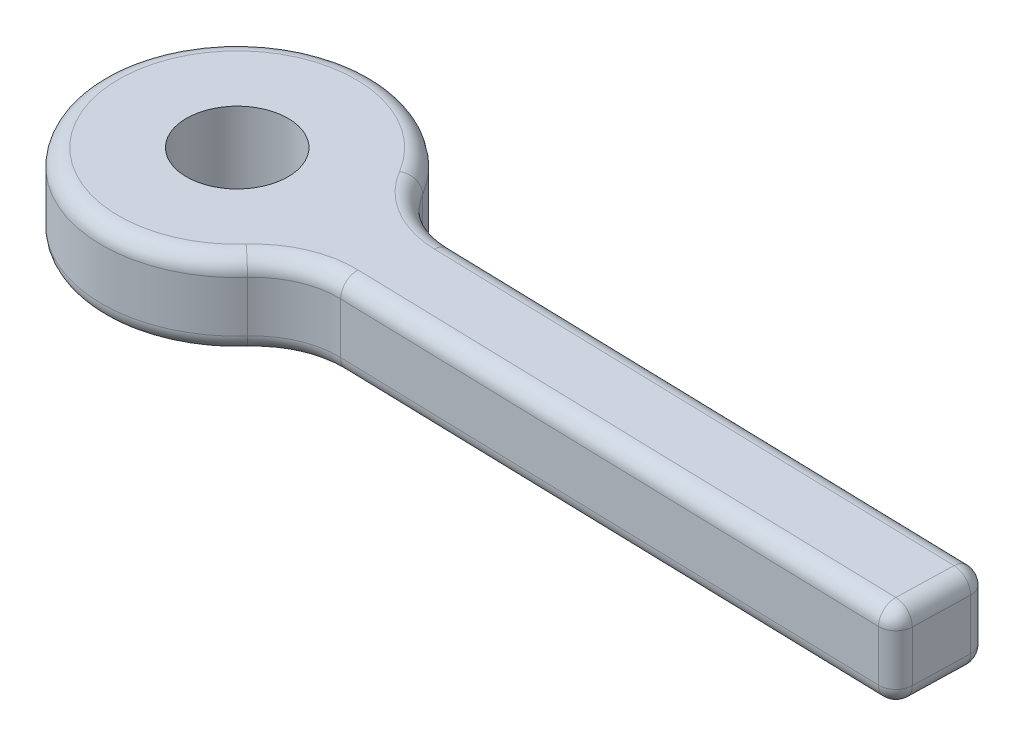
ISO-10303-21;
HEADER;
FILE_DESCRIPTION(('STEP AP214'),'2;1');
FILE_NAME('part.step','',(''),(''),'','','');
FILE_SCHEMA(('AUTOMOTIVE_DESIGN { 1 0 10303 214 1 1 1 1 }'));
ENDSEC;
DATA;
#1=APPLICATION_CONTEXT('core data for automotive mechanical design processes');
#2=APPLICATION_PROTOCOL_DEFINITION('international standard','automotive_design',2000,#1);
#3=PRODUCT_CONTEXT('',#1,'mechanical');
#4=PRODUCT('Part','Part','',(#3));
#5=PRODUCT_RELATED_PRODUCT_CATEGORY('part','',(#4));
#6=PRODUCT_DEFINITION_FORMATION('','',#4);
#7=PRODUCT_DEFINITION_CONTEXT('part definition',#1,'design');
#8=PRODUCT_DEFINITION('design','',#6,#7);
#9=PRODUCT_DEFINITION_SHAPE('','',#8);
#10=(LENGTH_UNIT() NAMED_UNIT(*) SI_UNIT(.MILLI.,.METRE.));
#11=(NAMED_UNIT(*) PLANE_ANGLE_UNIT() SI_UNIT($,.RADIAN.));
#12=(NAMED_UNIT(*) SI_UNIT($,.STERADIAN.) SOLID_ANGLE_UNIT());
#13=UNCERTAINTY_MEASURE_WITH_UNIT(LENGTH_MEASURE(1.E-05),#10,'distance_accuracy_value','');
#14=(GEOMETRIC_REPRESENTATION_CONTEXT(3) GLOBAL_UNCERTAINTY_ASSIGNED_CONTEXT((#13)) GLOBAL_UNIT_ASSIGNED_CONTEXT((#10,
#11,#12)) REPRESENTATION_CONTEXT('',''));
#15=CARTESIAN_POINT('',(0.,0.,0.));
#16=DIRECTION('',(0.,0.,1.));
#17=DIRECTION('',(1.,0.,0.));
#18=AXIS2_PLACEMENT_3D('',#15,#16,#17);
#19=CARTESIAN_POINT('',(0.423527405995183,116.08,-15.838627532734));
#20=DIRECTION('',(-0.0267306032413579,0.,0.999642673584093));
#21=DIRECTION('',(0.999642673584093,0.,0.0267306032413579));
#22=AXIS2_PLACEMENT_3D('',#19,#20,#21);
#23=PLANE('',#22);
#24=DIRECTION('',(0.,1.,0.));
#25=VECTOR('',#24,1.);
#26=CARTESIAN_POINT('',(5.37512005492349,116.08,-15.7062211619288));
#27=LINE('',#26,#25);
#28=CARTESIAN_POINT('',(5.37512005492349,117.08,-15.7062211619288));
#29=VERTEX_POINT('',#28);
#30=CARTESIAN_POINT('',(5.37512005492349,120.08,-15.7062211619288));
#31=VERTEX_POINT('',#30);
#32=EDGE_CURVE('E240',#29,#31,#27,.T.);
#33=ORIENTED_EDGE('',*,*,#32,.T.);
#34=DIRECTION('',(0.999642673584093,0.,0.0267306032413579));
#35=VECTOR('',#34,1.);
#36=CARTESIAN_POINT('',(-27.2826435868739,120.08,-16.5794949283727));
#37=LINE('',#36,#35);
#38=CARTESIAN_POINT('',(-27.2826435868739,120.08,-16.5794949283727));
#39=VERTEX_POINT('',#38);
#40=EDGE_CURVE('E242',#31,#39,#37,.F.);
#41=ORIENTED_EDGE('',*,*,#40,.T.);
#42=DIRECTION('',(0.,1.,0.));
#43=VECTOR('',#42,1.);
#44=CARTESIAN_POINT('',(-27.2826435868739,116.08,-16.5794949283727));
#45=LINE('',#44,#43);
#46=CARTESIAN_POINT('',(-27.2826435868739,117.08,-16.5794949283727));
#47=VERTEX_POINT('',#46);
#48=EDGE_CURVE('E160',#47,#39,#45,.T.);
#49=ORIENTED_EDGE('',*,*,#48,.F.);
#50=DIRECTION('',(0.999642673584093,0.,0.0267306032413579));
#51=VECTOR('',#50,1.);
#52=CARTESIAN_POINT('',(0.423527405995183,117.08,-15.838627532734));
#53=LINE('',#52,#51);
#54=EDGE_CURVE('E238',#47,#29,#53,.T.);
#55=ORIENTED_EDGE('',*,*,#54,.T.);
#56=EDGE_LOOP('',(#33,#41,#49,#55));
#57=FACE_BOUND('',#56,.T.);
#58=ADVANCED_FACE('F37',(#57),#23,.T.);
#59=CARTESIAN_POINT('',(-27.4162966030807,116.08,-11.5812815604523));
#60=DIRECTION('',(0.,1.,0.));
#61=DIRECTION('',(0.,0.,1.));
#62=AXIS2_PLACEMENT_3D('',#59,#60,#61);
#63=CYLINDRICAL_SURFACE('',#62,5.);
#64=ORIENTED_EDGE('',*,*,#48,.T.);
#65=CARTESIAN_POINT('',(-27.4162966030807,120.08,-11.5812815604523));
#66=DIRECTION('',(0.,-1.,0.));
#67=DIRECTION('',(0.,0.,-1.));
#68=AXIS2_PLACEMENT_3D('',#65,#66,#67);
#69=CIRCLE('',#68,5.);
#70=CARTESIAN_POINT('',(-31.1353115917015,120.08,-14.9232761018024));
#71=VERTEX_POINT('',#70);
#72=EDGE_CURVE('E247',#39,#71,#69,.F.);
#73=ORIENTED_EDGE('',*,*,#72,.T.);
#74=DIRECTION('',(0.,1.,0.));
#75=VECTOR('',#74,1.);
#76=CARTESIAN_POINT('',(-31.1353115917015,116.08,-14.9232761018024));
#77=LINE('',#76,#75);
#78=CARTESIAN_POINT('',(-31.1353115917015,117.08,-14.9232761018024));
#79=VERTEX_POINT('',#78);
#80=EDGE_CURVE('E227',#79,#71,#77,.T.);
#81=ORIENTED_EDGE('',*,*,#80,.F.);
#82=CARTESIAN_POINT('',(-27.4162966030807,117.08,-11.5812815604523));
#83=DIRECTION('',(0.,-1.,0.));
#84=DIRECTION('',(0.,0.,-1.));
#85=AXIS2_PLACEMENT_3D('',#82,#83,#84);
#86=CIRCLE('',#85,5.);
#87=EDGE_CURVE('E245',#79,#47,#86,.T.);
#88=ORIENTED_EDGE('',*,*,#87,.T.);
#89=EDGE_LOOP('',(#64,#73,#81,#88));
#90=FACE_BOUND('',#89,.T.);
#91=ADVANCED_FACE('F354',(#90),#63,.F.);
#92=CARTESIAN_POINT('',(-37.0857355734948,116.08,-20.2704673679625));
#93=DIRECTION('',(0.,1.,0.));
#94=DIRECTION('',(0.,0.,1.));
#95=AXIS2_PLACEMENT_3D('',#92,#93,#94);
#96=CYLINDRICAL_SURFACE('',#95,7.99999999999999);
#97=ORIENTED_EDGE('',*,*,#80,.T.);
#98=CARTESIAN_POINT('',(-37.0857355734948,120.08,-20.2704673679625));
#99=DIRECTION('',(0.,-1.,0.));
#100=DIRECTION('',(0.,0.,-1.));
#101=AXIS2_PLACEMENT_3D('',#98,#99,#100);
#102=CIRCLE('',#101,7.99999999999999);
#103=CARTESIAN_POINT('',(-30.2042001794121,120.08,-24.3502309174818));
#104=VERTEX_POINT('',#103);
#105=EDGE_CURVE('E251',#71,#104,#102,.T.);
#106=ORIENTED_EDGE('',*,*,#105,.T.);
#107=DIRECTION('',(0.,1.,0.));
#108=VECTOR('',#107,1.);
#109=CARTESIAN_POINT('',(-30.2042001794121,116.08,-24.3502309174818));
#110=LINE('',#109,#108);
#111=CARTESIAN_POINT('',(-30.2042001794121,117.08,-24.3502309174818));
#112=VERTEX_POINT('',#111);
#113=EDGE_CURVE('E224',#112,#104,#110,.T.);
#114=ORIENTED_EDGE('',*,*,#113,.F.);
#115=CARTESIAN_POINT('',(-37.0857355734948,117.08,-20.2704673679625));
#116=DIRECTION('',(0.,-1.,0.));
#117=DIRECTION('',(0.,0.,-1.));
#118=AXIS2_PLACEMENT_3D('',#115,#116,#117);
#119=CIRCLE('',#118,7.99999999999999);
#120=EDGE_CURVE('E249',#112,#79,#119,.F.);
#121=ORIENTED_EDGE('',*,*,#120,.T.);
#122=EDGE_LOOP('',(#97,#106,#114,#121));
#123=FACE_BOUND('',#122,.T.);
#124=ADVANCED_FACE('F302',(#123),#96,.T.);
#125=CARTESIAN_POINT('',(-25.9032405581103,116.08,-26.9000831359313));
#126=DIRECTION('',(0.,1.,0.));
#127=DIRECTION('',(0.,0.,1.));
#128=AXIS2_PLACEMENT_3D('',#125,#126,#127);
#129=CYLINDRICAL_SURFACE('',#128,5.);
#130=ORIENTED_EDGE('',*,*,#113,.T.);
#131=CARTESIAN_POINT('',(-25.9032405581103,120.08,-26.9000831359313));
#132=DIRECTION('',(0.,-1.,0.));
#133=DIRECTION('',(0.,0.,-1.));
#134=AXIS2_PLACEMENT_3D('',#131,#132,#133);
#135=CIRCLE('',#134,5.);
#136=CARTESIAN_POINT('',(-26.0368935743171,120.08,-21.9018697680109));
#137=VERTEX_POINT('',#136);
#138=EDGE_CURVE('E255',#104,#137,#135,.F.);
#139=ORIENTED_EDGE('',*,*,#138,.T.);
#140=DIRECTION('',(0.,1.,0.));
#141=VECTOR('',#140,1.);
#142=CARTESIAN_POINT('',(-26.0368935743171,116.08,-21.9018697680109));
#143=LINE('',#142,#141);
#144=CARTESIAN_POINT('',(-26.0368935743171,117.08,-21.9018697680109));
#145=VERTEX_POINT('',#144);
#146=EDGE_CURVE('E219',#145,#137,#143,.T.);
#147=ORIENTED_EDGE('',*,*,#146,.F.);
#148=CARTESIAN_POINT('',(-25.9032405581103,117.08,-26.9000831359313));
#149=DIRECTION('',(0.,-1.,0.));
#150=DIRECTION('',(0.,0.,-1.));
#151=AXIS2_PLACEMENT_3D('',#148,#149,#150);
#152=CIRCLE('',#151,5.);
#153=EDGE_CURVE('E253',#145,#112,#152,.T.);
#154=ORIENTED_EDGE('',*,*,#153,.T.);
#155=EDGE_LOOP('',(#130,#139,#147,#154));
#156=FACE_BOUND('',#155,.T.);
#157=ADVANCED_FACE('F306',(#156),#129,.F.);
#158=CARTESIAN_POINT('',(0.566636978916621,116.08,-21.1904871521726));
#159=DIRECTION('',(0.0267306032413582,0.,-0.999642673584093));
#160=DIRECTION('',(-0.999642673584093,0.,-0.0267306032413582));
#161=AXIS2_PLACEMENT_3D('',#158,#159,#160);
#162=PLANE('',#161);
#163=DIRECTION('',(0.,1.,0.));
#164=VECTOR('',#163,1.);
#165=CARTESIAN_POINT('',(5.51822962784493,116.08,-21.0580807813673));
#166=LINE('',#165,#164);
#167=CARTESIAN_POINT('',(5.51822962784493,120.08,-21.0580807813673));
#168=VERTEX_POINT('',#167);
#169=CARTESIAN_POINT('',(5.51822962784493,117.08,-21.0580807813673));
#170=VERTEX_POINT('',#169);
#171=EDGE_CURVE('E259',#168,#170,#166,.F.);
#172=ORIENTED_EDGE('',*,*,#171,.T.);
#173=DIRECTION('',(-0.999642673584093,0.,-0.0267306032413582));
#174=VECTOR('',#173,1.);
#175=CARTESIAN_POINT('',(0.566636978916621,117.08,-21.1904871521726));
#176=LINE('',#175,#174);
#177=EDGE_CURVE('E261',#170,#145,#176,.T.);
#178=ORIENTED_EDGE('',*,*,#177,.T.);
#179=ORIENTED_EDGE('',*,*,#146,.T.);
#180=DIRECTION('',(-0.999642673584093,0.,-0.0267306032413582));
#181=VECTOR('',#180,1.);
#182=CARTESIAN_POINT('',(6.51787230142902,120.08,-21.031350178126));
#183=LINE('',#182,#181);
#184=EDGE_CURVE('E257',#137,#168,#183,.F.);
#185=ORIENTED_EDGE('',*,*,#184,.T.);
#186=EDGE_LOOP('',(#172,#178,#179,#185));
#187=FACE_BOUND('',#186,.T.);
#188=ADVANCED_FACE('F348',(#187),#162,.T.);
#189=CARTESIAN_POINT('',(-37.0857355734948,116.08,-20.2704673679625));
#190=DIRECTION('',(0.,1.,0.));
#191=DIRECTION('',(0.,0.,1.));
#192=AXIS2_PLACEMENT_3D('',#189,#190,#191);
#193=CYLINDRICAL_SURFACE('',#192,3.);
#194=CARTESIAN_POINT('',(-37.0857355734948,116.08,-20.2704673679625));
#195=DIRECTION('',(0.,-1.,0.));
#196=DIRECTION('',(0.,0.,-1.));
#197=AXIS2_PLACEMENT_3D('',#194,#195,#196);
#198=CIRCLE('',#197,3.);
#199=CARTESIAN_POINT('',(-37.0857355734948,116.08,-23.2704673679625));
#200=VERTEX_POINT('',#199);
#201=EDGE_CURVE('E215',#200,#200,#198,.T.);
#202=ORIENTED_EDGE('',*,*,#201,.T.);
#203=EDGE_LOOP('',(#202));
#204=FACE_BOUND('',#203,.T.);
#205=CARTESIAN_POINT('',(-37.0857355734948,121.08,-20.2704673679625));
#206=DIRECTION('',(0.,-1.,0.));
#207=DIRECTION('',(0.,0.,-1.));
#208=AXIS2_PLACEMENT_3D('',#205,#206,#207);
#209=CIRCLE('',#208,3.);
#210=CARTESIAN_POINT('',(-37.0857355734948,121.08,-23.2704673679625));
#211=VERTEX_POINT('',#210);
#212=EDGE_CURVE('E209',#211,#211,#209,.T.);
#213=ORIENTED_EDGE('',*,*,#212,.F.);
#214=EDGE_LOOP('',(#213));
#215=FACE_BOUND('',#214,.T.);
#216=ADVANCED_FACE('F340',(#204,#215),#193,.F.);
#217=CARTESIAN_POINT('',(5.9512353225124,116.08,0.159136974046608));
#218=DIRECTION('',(0.999642673584093,0.,0.026730603241358));
#219=DIRECTION('',(0.026730603241358,0.,-0.999642673584093));
#220=AXIS2_PLACEMENT_3D('',#217,#218,#219);
#221=PLANE('',#220);
#222=DIRECTION('',(0.026730603241358,0.,-0.999642673584093));
#223=VECTOR('',#222,1.);
#224=CARTESIAN_POINT('',(5.9512353225124,117.08,0.159136974046608));
#225=LINE('',#224,#223);
#226=CARTESIAN_POINT('',(6.40149333174894,117.08,-16.6791332322715));
#227=VERTEX_POINT('',#226);
#228=CARTESIAN_POINT('',(6.49114169818766,117.08,-20.0317075045419));
#229=VERTEX_POINT('',#228);
#230=EDGE_CURVE('E46',#227,#229,#225,.T.);
#231=ORIENTED_EDGE('',*,*,#230,.T.);
#232=DIRECTION('',(0.,1.,0.));
#233=VECTOR('',#232,1.);
#234=CARTESIAN_POINT('',(6.49114169818766,116.08,-20.0317075045419));
#235=LINE('',#234,#233);
#236=CARTESIAN_POINT('',(6.49114169818766,120.08,-20.0317075045419));
#237=VERTEX_POINT('',#236);
#238=EDGE_CURVE('E11',#229,#237,#235,.T.);
#239=ORIENTED_EDGE('',*,*,#238,.T.);
#240=DIRECTION('',(0.026730603241358,0.,-0.999642673584093));
#241=VECTOR('',#240,1.);
#242=CARTESIAN_POINT('',(6.37476272850759,120.08,-15.6794905586874));
#243=LINE('',#242,#241);
#244=CARTESIAN_POINT('',(6.40149333174894,120.08,-16.6791332322715));
#245=VERTEX_POINT('',#244);
#246=EDGE_CURVE('E170',#237,#245,#243,.F.);
#247=ORIENTED_EDGE('',*,*,#246,.T.);
#248=DIRECTION('',(0.,1.,0.));
#249=VECTOR('',#248,1.);
#250=CARTESIAN_POINT('',(6.40149333174894,116.08,-16.6791332322715));
#251=LINE('',#250,#249);
#252=EDGE_CURVE('E57',#245,#227,#251,.F.);
#253=ORIENTED_EDGE('',*,*,#252,.T.);
#254=EDGE_LOOP('',(#231,#239,#247,#253));
#255=FACE_BOUND('',#254,.T.);
#256=ADVANCED_FACE('F337',(#255),#221,.T.);
#257=CARTESIAN_POINT('',(0.,116.08,0.));
#258=DIRECTION('',(0.,-1.,0.));
#259=DIRECTION('',(0.,0.,-1.));
#260=AXIS2_PLACEMENT_3D('',#257,#258,#259);
#261=PLANE('',#260);
#262=CARTESIAN_POINT('',(-25.9032405581103,116.08,-26.9000831359313));
#263=DIRECTION('',(0.,-1.,0.));
#264=DIRECTION('',(0.,0.,-1.));
#265=AXIS2_PLACEMENT_3D('',#262,#263,#264);
#266=CIRCLE('',#265,6.);
#267=CARTESIAN_POINT('',(-31.0643921036724,116.08,-23.8402604737919));
#268=VERTEX_POINT('',#267);
#269=CARTESIAN_POINT('',(-26.0636241775585,116.08,-20.9022270944268));
#270=VERTEX_POINT('',#269);
#271=EDGE_CURVE('E271',#268,#270,#266,.F.);
#272=ORIENTED_EDGE('',*,*,#271,.T.);
#273=DIRECTION('',(-0.999642673584093,0.,-0.0267306032413582));
#274=VECTOR('',#273,1.);
#275=CARTESIAN_POINT('',(0.539906375675262,116.08,-20.1908444785885));
#276=LINE('',#275,#274);
#277=CARTESIAN_POINT('',(5.49149902460357,116.08,-20.0584381077832));
#278=VERTEX_POINT('',#277);
#279=EDGE_CURVE('E273',#270,#278,#276,.F.);
#280=ORIENTED_EDGE('',*,*,#279,.T.);
#281=DIRECTION('',(0.026730603241358,0.,-0.999642673584093));
#282=VECTOR('',#281,1.);
#283=CARTESIAN_POINT('',(4.95159264892831,116.08,0.132406370805251));
#284=LINE('',#283,#282);
#285=CARTESIAN_POINT('',(5.40185065816485,116.08,-16.7058638355128));
#286=VERTEX_POINT('',#285);
#287=EDGE_CURVE('E265',#278,#286,#284,.F.);
#288=ORIENTED_EDGE('',*,*,#287,.T.);
#289=DIRECTION('',(0.999642673584093,0.,0.0267306032413579));
#290=VECTOR('',#289,1.);
#291=CARTESIAN_POINT('',(0.450258009236541,116.08,-16.8382702063181));
#292=LINE('',#291,#290);
#293=CARTESIAN_POINT('',(-27.2559129836326,116.08,-17.5791376019568));
#294=VERTEX_POINT('',#293);
#295=EDGE_CURVE('E263',#286,#294,#292,.F.);
#296=ORIENTED_EDGE('',*,*,#295,.T.);
#297=CARTESIAN_POINT('',(-27.4162966030807,116.08,-11.5812815604523));
#298=DIRECTION('',(0.,-1.,0.));
#299=DIRECTION('',(0.,0.,-1.));
#300=AXIS2_PLACEMENT_3D('',#297,#298,#299);
#301=CIRCLE('',#300,6.);
#302=CARTESIAN_POINT('',(-31.8791145894257,116.08,-15.5916750100724));
#303=VERTEX_POINT('',#302);
#304=EDGE_CURVE('E267',#294,#303,#301,.F.);
#305=ORIENTED_EDGE('',*,*,#304,.T.);
#306=CARTESIAN_POINT('',(-37.0857355734948,116.08,-20.2704673679625));
#307=DIRECTION('',(0.,-1.,0.));
#308=DIRECTION('',(0.,0.,-1.));
#309=AXIS2_PLACEMENT_3D('',#306,#307,#308);
#310=CIRCLE('',#309,6.99999999999999);
#311=EDGE_CURVE('E269',#303,#268,#310,.T.);
#312=ORIENTED_EDGE('',*,*,#311,.T.);
#313=EDGE_LOOP('',(#272,#280,#288,#296,#305,#312));
#314=FACE_BOUND('',#313,.T.);
#315=ORIENTED_EDGE('',*,*,#201,.F.);
#316=EDGE_LOOP('',(#315));
#317=FACE_BOUND('',#316,.T.);
#318=ADVANCED_FACE('F339',(#314,#317),#261,.T.);
#319=CARTESIAN_POINT('',(0.,121.08,0.));
#320=DIRECTION('',(0.,-1.,0.));
#321=DIRECTION('',(0.,0.,-1.));
#322=AXIS2_PLACEMENT_3D('',#319,#320,#321);
#323=PLANE('',#322);
#324=CARTESIAN_POINT('',(-27.4162966030807,121.08,-11.5812815604523));
#325=DIRECTION('',(0.,-1.,0.));
#326=DIRECTION('',(0.,0.,-1.));
#327=AXIS2_PLACEMENT_3D('',#324,#325,#326);
#328=CIRCLE('',#327,6.);
#329=CARTESIAN_POINT('',(-31.8791145894257,121.08,-15.5916750100724));
#330=VERTEX_POINT('',#329);
#331=CARTESIAN_POINT('',(-27.2559129836326,121.08,-17.5791376019568));
#332=VERTEX_POINT('',#331);
#333=EDGE_CURVE('E235',#330,#332,#328,.T.);
#334=ORIENTED_EDGE('',*,*,#333,.T.);
#335=DIRECTION('',(0.999642673584093,0.,0.0267306032413579));
#336=VECTOR('',#335,1.);
#337=CARTESIAN_POINT('',(6.40149333174895,121.08,-16.6791332322715));
#338=LINE('',#337,#336);
#339=CARTESIAN_POINT('',(5.40185065816485,121.08,-16.7058638355128));
#340=VERTEX_POINT('',#339);
#341=EDGE_CURVE('E144',#332,#340,#338,.T.);
#342=ORIENTED_EDGE('',*,*,#341,.T.);
#343=DIRECTION('',(0.026730603241358,0.,-0.999642673584093));
#344=VECTOR('',#343,1.);
#345=CARTESIAN_POINT('',(5.51822962784493,121.08,-21.0580807813673));
#346=LINE('',#345,#344);
#347=CARTESIAN_POINT('',(5.49149902460357,121.08,-20.0584381077832));
#348=VERTEX_POINT('',#347);
#349=EDGE_CURVE('E137',#340,#348,#346,.T.);
#350=ORIENTED_EDGE('',*,*,#349,.T.);
#351=DIRECTION('',(-0.999642673584093,0.,-0.0267306032413582));
#352=VECTOR('',#351,1.);
#353=CARTESIAN_POINT('',(-26.0636241775585,121.08,-20.9022270944268));
#354=LINE('',#353,#352);
#355=CARTESIAN_POINT('',(-26.0636241775585,121.08,-20.9022270944268));
#356=VERTEX_POINT('',#355);
#357=EDGE_CURVE('E141',#348,#356,#354,.T.);
#358=ORIENTED_EDGE('',*,*,#357,.T.);
#359=CARTESIAN_POINT('',(-25.9032405581103,121.08,-26.9000831359313));
#360=DIRECTION('',(0.,-1.,0.));
#361=DIRECTION('',(0.,0.,-1.));
#362=AXIS2_PLACEMENT_3D('',#359,#360,#361);
#363=CIRCLE('',#362,6.);
#364=CARTESIAN_POINT('',(-31.0643921036724,121.08,-23.8402604737919));
#365=VERTEX_POINT('',#364);
#366=EDGE_CURVE('E148',#356,#365,#363,.T.);
#367=ORIENTED_EDGE('',*,*,#366,.T.);
#368=CARTESIAN_POINT('',(-37.0857355734948,121.08,-20.2704673679625));
#369=DIRECTION('',(0.,-1.,0.));
#370=DIRECTION('',(0.,0.,-1.));
#371=AXIS2_PLACEMENT_3D('',#368,#369,#370);
#372=CIRCLE('',#371,6.99999999999999);
#373=EDGE_CURVE('E233',#365,#330,#372,.F.);
#374=ORIENTED_EDGE('',*,*,#373,.T.);
#375=EDGE_LOOP('',(#334,#342,#350,#358,#367,#374));
#376=FACE_BOUND('',#375,.T.);
#377=ORIENTED_EDGE('',*,*,#212,.T.);
#378=EDGE_LOOP('',(#377));
#379=FACE_BOUND('',#378,.T.);
#380=ADVANCED_FACE('F139',(#376,#379),#323,.F.);
#381=CARTESIAN_POINT('',(-25.9032405581103,117.08,-26.9000831359313));
#382=DIRECTION('',(0.,-1.,0.));
#383=DIRECTION('',(0.,0.,-1.));
#384=AXIS2_PLACEMENT_3D('',#381,#382,#383);
#385=TOROIDAL_SURFACE('',#384,6.,1.);
#386=CARTESIAN_POINT('',(-31.0643921036724,117.08,-23.8402604737919));
#387=DIRECTION('',(-0.50997044368991,0.,-0.860191924260346));
#388=DIRECTION('',(-0.860191924260346,0.,0.50997044368991));
#389=AXIS2_PLACEMENT_3D('',#386,#387,#388);
#390=CIRCLE('',#389,1.);
#391=EDGE_CURVE('E202',#112,#268,#390,.T.);
#392=ORIENTED_EDGE('',*,*,#391,.F.);
#393=ORIENTED_EDGE('',*,*,#153,.F.);
#394=CARTESIAN_POINT('',(-26.0636241775585,117.08,-20.9022270944268));
#395=DIRECTION('',(0.999642673584093,0.,0.0267306032413587));
#396=DIRECTION('',(0.0267306032413587,0.,-0.999642673584093));
#397=AXIS2_PLACEMENT_3D('',#394,#395,#396);
#398=CIRCLE('',#397,1.);
#399=EDGE_CURVE('E41',#270,#145,#398,.T.);
#400=ORIENTED_EDGE('',*,*,#399,.F.);
#401=ORIENTED_EDGE('',*,*,#271,.F.);
#402=EDGE_LOOP('',(#392,#393,#400,#401));
#403=FACE_BOUND('',#402,.T.);
#404=ADVANCED_FACE('F39',(#403),#385,.T.);
#405=CARTESIAN_POINT('',(0.539906375675262,117.08,-20.1908444785885));
#406=DIRECTION('',(-0.999642673584093,0.,-0.0267306032413582));
#407=DIRECTION('',(-0.0267306032413582,0.,0.999642673584093));
#408=AXIS2_PLACEMENT_3D('',#405,#406,#407);
#409=CYLINDRICAL_SURFACE('',#408,1.);
#410=ORIENTED_EDGE('',*,*,#399,.T.);
#411=ORIENTED_EDGE('',*,*,#177,.F.);
#412=CARTESIAN_POINT('',(5.49149902460357,117.08,-20.0584381077832));
#413=DIRECTION('',(0.999642673584093,0.,0.0267306032413579));
#414=DIRECTION('',(0.0267306032413579,0.,-0.999642673584093));
#415=AXIS2_PLACEMENT_3D('',#412,#413,#414);
#416=CIRCLE('',#415,1.);
#417=EDGE_CURVE('E200',#278,#170,#416,.T.);
#418=ORIENTED_EDGE('',*,*,#417,.F.);
#419=ORIENTED_EDGE('',*,*,#279,.F.);
#420=EDGE_LOOP('',(#410,#411,#418,#419));
#421=FACE_BOUND('',#420,.T.);
#422=ADVANCED_FACE('F400',(#421),#409,.T.);
#423=CARTESIAN_POINT('',(-37.0857355734948,117.08,-20.2704673679625));
#424=DIRECTION('',(0.,-1.,0.));
#425=DIRECTION('',(0.,0.,-1.));
#426=AXIS2_PLACEMENT_3D('',#423,#424,#425);
#427=TOROIDAL_SURFACE('',#426,6.99999999999999,1.);
#428=ORIENTED_EDGE('',*,*,#391,.T.);
#429=ORIENTED_EDGE('',*,*,#311,.F.);
#430=CARTESIAN_POINT('',(-31.8791145894257,117.08,-15.5916750100724));
#431=DIRECTION('',(0.668398908270016,0.,-0.743802997724163));
#432=DIRECTION('',(-0.743802997724163,0.,-0.668398908270016));
#433=AXIS2_PLACEMENT_3D('',#430,#431,#432);
#434=CIRCLE('',#433,1.);
#435=EDGE_CURVE('E197',#79,#303,#434,.T.);
#436=ORIENTED_EDGE('',*,*,#435,.F.);
#437=ORIENTED_EDGE('',*,*,#120,.F.);
#438=EDGE_LOOP('',(#428,#429,#436,#437));
#439=FACE_BOUND('',#438,.T.);
#440=ADVANCED_FACE('F398',(#439),#427,.T.);
#441=CARTESIAN_POINT('',(5.49149902460357,117.08,-20.0584381077832));
#442=DIRECTION('',(0.,0.,1.));
#443=DIRECTION('',(1.,0.,0.));
#444=AXIS2_PLACEMENT_3D('',#441,#442,#443);
#445=SPHERICAL_SURFACE('',#444,1.);
#446=CARTESIAN_POINT('',(5.49149902460357,117.08,-20.0584381077832));
#447=DIRECTION('',(0.0267306032413587,0.,-0.999642673584093));
#448=DIRECTION('',(-0.999642673584093,0.,-0.0267306032413587));
#449=AXIS2_PLACEMENT_3D('',#446,#447,#448);
#450=CIRCLE('',#449,1.);
#451=EDGE_CURVE('E192',#278,#229,#450,.F.);
#452=ORIENTED_EDGE('',*,*,#451,.F.);
#453=ORIENTED_EDGE('',*,*,#417,.T.);
#454=CARTESIAN_POINT('',(5.49149902460357,117.08,-20.0584381077832));
#455=DIRECTION('',(0.,-1.,0.));
#456=DIRECTION('',(0.,0.,-1.));
#457=AXIS2_PLACEMENT_3D('',#454,#455,#456);
#458=CIRCLE('',#457,1.);
#459=EDGE_CURVE('E194',#229,#170,#458,.F.);
#460=ORIENTED_EDGE('',*,*,#459,.F.);
#461=EDGE_LOOP('',(#452,#453,#460));
#462=FACE_BOUND('',#461,.T.);
#463=ADVANCED_FACE('F333',(#462),#445,.T.);
#464=CARTESIAN_POINT('',(-27.4162966030807,117.08,-11.5812815604523));
#465=DIRECTION('',(0.,-1.,0.));
#466=DIRECTION('',(0.,0.,-1.));
#467=AXIS2_PLACEMENT_3D('',#464,#465,#466);
#468=TOROIDAL_SURFACE('',#467,6.,1.);
#469=ORIENTED_EDGE('',*,*,#435,.T.);
#470=ORIENTED_EDGE('',*,*,#304,.F.);
#471=CARTESIAN_POINT('',(-27.2559129836326,117.08,-17.5791376019568));
#472=DIRECTION('',(0.999642673584093,0.,0.0267306032413587));
#473=DIRECTION('',(0.0267306032413587,0.,-0.999642673584093));
#474=AXIS2_PLACEMENT_3D('',#471,#472,#473);
#475=CIRCLE('',#474,1.);
#476=EDGE_CURVE('E189',#47,#294,#475,.T.);
#477=ORIENTED_EDGE('',*,*,#476,.F.);
#478=ORIENTED_EDGE('',*,*,#87,.F.);
#479=EDGE_LOOP('',(#469,#470,#477,#478));
#480=FACE_BOUND('',#479,.T.);
#481=ADVANCED_FACE('F392',(#480),#468,.T.);
#482=CARTESIAN_POINT('',(0.539906375675262,120.08,-20.1908444785885));
#483=DIRECTION('',(0.999642673584093,0.,0.0267306032413582));
#484=DIRECTION('',(0.0267306032413582,0.,-0.999642673584093));
#485=AXIS2_PLACEMENT_3D('',#482,#483,#484);
#486=CYLINDRICAL_SURFACE('',#485,1.);
#487=CARTESIAN_POINT('',(5.49149902460357,120.08,-20.0584381077832));
#488=DIRECTION('',(0.999642673584093,0.,0.0267306032413579));
#489=DIRECTION('',(0.0267306032413579,0.,-0.999642673584093));
#490=AXIS2_PLACEMENT_3D('',#487,#488,#489);
#491=CIRCLE('',#490,1.);
#492=EDGE_CURVE('E155',#168,#348,#491,.T.);
#493=ORIENTED_EDGE('',*,*,#492,.F.);
#494=ORIENTED_EDGE('',*,*,#184,.F.);
#495=CARTESIAN_POINT('',(-26.0636241775585,120.08,-20.9022270944268));
#496=DIRECTION('',(-0.999642673584093,0.,-0.0267306032413588));
#497=DIRECTION('',(-0.0267306032413588,0.,0.999642673584093));
#498=AXIS2_PLACEMENT_3D('',#495,#496,#497);
#499=CIRCLE('',#498,1.);
#500=EDGE_CURVE('E158',#356,#137,#499,.T.);
#501=ORIENTED_EDGE('',*,*,#500,.F.);
#502=ORIENTED_EDGE('',*,*,#357,.F.);
#503=EDGE_LOOP('',(#493,#494,#501,#502));
#504=FACE_BOUND('',#503,.T.);
#505=ADVANCED_FACE('F153',(#504),#486,.T.);
#506=CARTESIAN_POINT('',(5.49149902460357,116.08,-20.0584381077832));
#507=DIRECTION('',(0.,1.,0.));
#508=DIRECTION('',(0.,0.,1.));
#509=AXIS2_PLACEMENT_3D('',#506,#507,#508);
#510=CYLINDRICAL_SURFACE('',#509,1.);
#511=ORIENTED_EDGE('',*,*,#459,.T.);
#512=ORIENTED_EDGE('',*,*,#171,.F.);
#513=CARTESIAN_POINT('',(5.49149902460357,120.08,-20.0584381077832));
#514=DIRECTION('',(0.,1.,0.));
#515=DIRECTION('',(0.,0.,1.));
#516=AXIS2_PLACEMENT_3D('',#513,#514,#515);
#517=CIRCLE('',#516,1.);
#518=EDGE_CURVE('E167',#237,#168,#517,.T.);
#519=ORIENTED_EDGE('',*,*,#518,.F.);
#520=ORIENTED_EDGE('',*,*,#238,.F.);
#521=EDGE_LOOP('',(#511,#512,#519,#520));
#522=FACE_BOUND('',#521,.T.);
#523=ADVANCED_FACE('F336',(#522),#510,.T.);
#524=CARTESIAN_POINT('',(4.95159264892831,117.08,0.132406370805251));
#525=DIRECTION('',(0.026730603241358,0.,-0.999642673584093));
#526=DIRECTION('',(-0.999642673584093,0.,-0.026730603241358));
#527=AXIS2_PLACEMENT_3D('',#524,#525,#526);
#528=CYLINDRICAL_SURFACE('',#527,1.);
#529=ORIENTED_EDGE('',*,*,#451,.T.);
#530=ORIENTED_EDGE('',*,*,#230,.F.);
#531=CARTESIAN_POINT('',(5.40185065816485,117.08,-16.7058638355128));
#532=DIRECTION('',(-0.0267306032413588,0.,0.999642673584093));
#533=DIRECTION('',(0.999642673584093,0.,0.0267306032413588));
#534=AXIS2_PLACEMENT_3D('',#531,#532,#533);
#535=CIRCLE('',#534,1.);
#536=EDGE_CURVE('E184',#286,#227,#535,.T.);
#537=ORIENTED_EDGE('',*,*,#536,.F.);
#538=ORIENTED_EDGE('',*,*,#287,.F.);
#539=EDGE_LOOP('',(#529,#530,#537,#538));
#540=FACE_BOUND('',#539,.T.);
#541=ADVANCED_FACE('F327',(#540),#528,.T.);
#542=CARTESIAN_POINT('',(0.450258009236541,117.08,-16.8382702063181));
#543=DIRECTION('',(0.999642673584093,0.,0.0267306032413579));
#544=DIRECTION('',(0.0267306032413579,0.,-0.999642673584093));
#545=AXIS2_PLACEMENT_3D('',#542,#543,#544);
#546=CYLINDRICAL_SURFACE('',#545,1.);
#547=ORIENTED_EDGE('',*,*,#476,.T.);
#548=ORIENTED_EDGE('',*,*,#295,.F.);
#549=CARTESIAN_POINT('',(5.40185065816485,117.08,-16.7058638355128));
#550=DIRECTION('',(0.999642673584093,0.,0.0267306032413579));
#551=DIRECTION('',(0.0267306032413579,0.,-0.999642673584093));
#552=AXIS2_PLACEMENT_3D('',#549,#550,#551);
#553=CIRCLE('',#552,1.);
#554=EDGE_CURVE('E175',#29,#286,#553,.T.);
#555=ORIENTED_EDGE('',*,*,#554,.F.);
#556=ORIENTED_EDGE('',*,*,#54,.F.);
#557=EDGE_LOOP('',(#547,#548,#555,#556));
#558=FACE_BOUND('',#557,.T.);
#559=ADVANCED_FACE('F382',(#558),#546,.T.);
#560=CARTESIAN_POINT('',(-25.9032405581103,120.08,-26.9000831359313));
#561=DIRECTION('',(0.,-1.,0.));
#562=DIRECTION('',(0.,0.,-1.));
#563=AXIS2_PLACEMENT_3D('',#560,#561,#562);
#564=TOROIDAL_SURFACE('',#563,6.,1.);
#565=ORIENTED_EDGE('',*,*,#500,.T.);
#566=ORIENTED_EDGE('',*,*,#138,.F.);
#567=CARTESIAN_POINT('',(-31.0643921036724,120.08,-23.8402604737919));
#568=DIRECTION('',(-0.50997044368991,0.,-0.860191924260346));
#569=DIRECTION('',(-0.860191924260346,0.,0.50997044368991));
#570=AXIS2_PLACEMENT_3D('',#567,#568,#569);
#571=CIRCLE('',#570,1.);
#572=EDGE_CURVE('E171',#365,#104,#571,.T.);
#573=ORIENTED_EDGE('',*,*,#572,.F.);
#574=ORIENTED_EDGE('',*,*,#366,.F.);
#575=EDGE_LOOP('',(#565,#566,#573,#574));
#576=FACE_BOUND('',#575,.T.);
#577=ADVANCED_FACE('F310',(#576),#564,.T.);
#578=CARTESIAN_POINT('',(5.49149902460357,120.08,-20.0584381077832));
#579=DIRECTION('',(0.,0.,1.));
#580=DIRECTION('',(1.,0.,0.));
#581=AXIS2_PLACEMENT_3D('',#578,#579,#580);
#582=SPHERICAL_SURFACE('',#581,1.);
#583=ORIENTED_EDGE('',*,*,#518,.T.);
#584=ORIENTED_EDGE('',*,*,#492,.T.);
#585=CARTESIAN_POINT('',(5.49149902460357,120.08,-20.0584381077832));
#586=DIRECTION('',(0.0267306032413588,0.,-0.999642673584093));
#587=DIRECTION('',(-0.999642673584093,0.,-0.0267306032413588));
#588=AXIS2_PLACEMENT_3D('',#585,#586,#587);
#589=CIRCLE('',#588,1.);
#590=EDGE_CURVE('E165',#237,#348,#589,.F.);
#591=ORIENTED_EDGE('',*,*,#590,.F.);
#592=EDGE_LOOP('',(#583,#584,#591));
#593=FACE_BOUND('',#592,.T.);
#594=ADVANCED_FACE('F164',(#593),#582,.T.);
#595=CARTESIAN_POINT('',(5.40185065816485,117.08,-16.7058638355128));
#596=DIRECTION('',(0.,0.,1.));
#597=DIRECTION('',(1.,0.,0.));
#598=AXIS2_PLACEMENT_3D('',#595,#596,#597);
#599=SPHERICAL_SURFACE('',#598,1.);
#600=ORIENTED_EDGE('',*,*,#554,.T.);
#601=ORIENTED_EDGE('',*,*,#536,.T.);
#602=CARTESIAN_POINT('',(5.40185065816485,117.08,-16.7058638355128));
#603=DIRECTION('',(0.,-1.,0.));
#604=DIRECTION('',(0.,0.,-1.));
#605=AXIS2_PLACEMENT_3D('',#602,#603,#604);
#606=CIRCLE('',#605,1.);
#607=EDGE_CURVE('E172',#29,#227,#606,.F.);
#608=ORIENTED_EDGE('',*,*,#607,.F.);
#609=EDGE_LOOP('',(#600,#601,#608));
#610=FACE_BOUND('',#609,.T.);
#611=ADVANCED_FACE('F323',(#610),#599,.T.);
#612=CARTESIAN_POINT('',(-37.0857355734948,120.08,-20.2704673679625));
#613=DIRECTION('',(0.,-1.,0.));
#614=DIRECTION('',(0.,0.,-1.));
#615=AXIS2_PLACEMENT_3D('',#612,#613,#614);
#616=TOROIDAL_SURFACE('',#615,6.99999999999999,1.);
#617=ORIENTED_EDGE('',*,*,#572,.T.);
#618=ORIENTED_EDGE('',*,*,#105,.F.);
#619=CARTESIAN_POINT('',(-31.8791145894257,120.08,-15.5916750100724));
#620=DIRECTION('',(0.668398908270016,0.,-0.743802997724163));
#621=DIRECTION('',(-0.743802997724163,0.,-0.668398908270016));
#622=AXIS2_PLACEMENT_3D('',#619,#620,#621);
#623=CIRCLE('',#622,1.);
#624=EDGE_CURVE('E178',#330,#71,#623,.T.);
#625=ORIENTED_EDGE('',*,*,#624,.F.);
#626=ORIENTED_EDGE('',*,*,#373,.F.);
#627=EDGE_LOOP('',(#617,#618,#625,#626));
#628=FACE_BOUND('',#627,.T.);
#629=ADVANCED_FACE('F298',(#628),#616,.T.);
#630=CARTESIAN_POINT('',(4.95159264892831,120.08,0.132406370805251));
#631=DIRECTION('',(-0.026730603241358,0.,0.999642673584093));
#632=DIRECTION('',(0.999642673584093,0.,0.026730603241358));
#633=AXIS2_PLACEMENT_3D('',#630,#631,#632);
#634=CYLINDRICAL_SURFACE('',#633,1.);
#635=ORIENTED_EDGE('',*,*,#590,.T.);
#636=ORIENTED_EDGE('',*,*,#349,.F.);
#637=CARTESIAN_POINT('',(5.40185065816485,120.08,-16.7058638355128));
#638=DIRECTION('',(-0.0267306032413587,0.,0.999642673584093));
#639=DIRECTION('',(0.999642673584093,0.,0.0267306032413587));
#640=AXIS2_PLACEMENT_3D('',#637,#638,#639);
#641=CIRCLE('',#640,1.);
#642=EDGE_CURVE('E286',#245,#340,#641,.T.);
#643=ORIENTED_EDGE('',*,*,#642,.F.);
#644=ORIENTED_EDGE('',*,*,#246,.F.);
#645=EDGE_LOOP('',(#635,#636,#643,#644));
#646=FACE_BOUND('',#645,.T.);
#647=ADVANCED_FACE('F169',(#646),#634,.T.);
#648=CARTESIAN_POINT('',(5.40185065816485,116.08,-16.7058638355128));
#649=DIRECTION('',(0.,1.,0.));
#650=DIRECTION('',(0.,0.,1.));
#651=AXIS2_PLACEMENT_3D('',#648,#649,#650);
#652=CYLINDRICAL_SURFACE('',#651,1.);
#653=ORIENTED_EDGE('',*,*,#607,.T.);
#654=ORIENTED_EDGE('',*,*,#252,.F.);
#655=CARTESIAN_POINT('',(5.40185065816485,120.08,-16.7058638355128));
#656=DIRECTION('',(0.,1.,0.));
#657=DIRECTION('',(0.,0.,1.));
#658=AXIS2_PLACEMENT_3D('',#655,#656,#657);
#659=CIRCLE('',#658,1.);
#660=EDGE_CURVE('E283',#31,#245,#659,.T.);
#661=ORIENTED_EDGE('',*,*,#660,.F.);
#662=ORIENTED_EDGE('',*,*,#32,.F.);
#663=EDGE_LOOP('',(#653,#654,#661,#662));
#664=FACE_BOUND('',#663,.T.);
#665=ADVANCED_FACE('F320',(#664),#652,.T.);
#666=CARTESIAN_POINT('',(-27.4162966030807,120.08,-11.5812815604523));
#667=DIRECTION('',(0.,-1.,0.));
#668=DIRECTION('',(0.,0.,-1.));
#669=AXIS2_PLACEMENT_3D('',#666,#667,#668);
#670=TOROIDAL_SURFACE('',#669,6.,1.);
#671=ORIENTED_EDGE('',*,*,#624,.T.);
#672=ORIENTED_EDGE('',*,*,#72,.F.);
#673=CARTESIAN_POINT('',(-27.2559129836326,120.08,-17.5791376019568));
#674=DIRECTION('',(0.999642673584093,0.,0.0267306032413587));
#675=DIRECTION('',(0.0267306032413587,0.,-0.999642673584093));
#676=AXIS2_PLACEMENT_3D('',#673,#674,#675);
#677=CIRCLE('',#676,1.);
#678=EDGE_CURVE('E281',#332,#39,#677,.T.);
#679=ORIENTED_EDGE('',*,*,#678,.F.);
#680=ORIENTED_EDGE('',*,*,#333,.F.);
#681=EDGE_LOOP('',(#671,#672,#679,#680));
#682=FACE_BOUND('',#681,.T.);
#683=ADVANCED_FACE('F293',(#682),#670,.T.);
#684=CARTESIAN_POINT('',(5.40185065816485,120.08,-16.7058638355128));
#685=DIRECTION('',(0.,0.,1.));
#686=DIRECTION('',(1.,0.,0.));
#687=AXIS2_PLACEMENT_3D('',#684,#685,#686);
#688=SPHERICAL_SURFACE('',#687,1.);
#689=ORIENTED_EDGE('',*,*,#660,.T.);
#690=ORIENTED_EDGE('',*,*,#642,.T.);
#691=CARTESIAN_POINT('',(5.40185065816485,120.08,-16.7058638355128));
#692=DIRECTION('',(0.999642673584093,0.,0.0267306032413587));
#693=DIRECTION('',(0.0267306032413587,0.,-0.999642673584093));
#694=AXIS2_PLACEMENT_3D('',#691,#692,#693);
#695=CIRCLE('',#694,1.);
#696=EDGE_CURVE('E279',#31,#340,#695,.F.);
#697=ORIENTED_EDGE('',*,*,#696,.F.);
#698=EDGE_LOOP('',(#689,#690,#697));
#699=FACE_BOUND('',#698,.T.);
#700=ADVANCED_FACE('F316',(#699),#688,.T.);
#701=CARTESIAN_POINT('',(0.450258009236541,120.08,-16.8382702063181));
#702=DIRECTION('',(-0.999642673584093,0.,-0.0267306032413579));
#703=DIRECTION('',(-0.0267306032413579,0.,0.999642673584093));
#704=AXIS2_PLACEMENT_3D('',#701,#702,#703);
#705=CYLINDRICAL_SURFACE('',#704,1.);
#706=ORIENTED_EDGE('',*,*,#678,.T.);
#707=ORIENTED_EDGE('',*,*,#40,.F.);
#708=ORIENTED_EDGE('',*,*,#696,.T.);
#709=ORIENTED_EDGE('',*,*,#341,.F.);
#710=EDGE_LOOP('',(#706,#707,#708,#709));
#711=FACE_BOUND('',#710,.T.);
#712=ADVANCED_FACE('F313',(#711),#705,.T.);
#713=CLOSED_SHELL('',(#58,#91,#124,#157,#188,#216,#256,#318,#380,#404,#422,#440,#463,#481,#505,
#523,#541,#559,#577,#594,#611,#629,#647,#665,#683,#700,#712));
#714=MANIFOLD_SOLID_BREP('B2',#713);
#715=ADVANCED_BREP_SHAPE_REPRESENTATION('',(#18,#714),#14);
#716=SHAPE_DEFINITION_REPRESENTATION(#9,#715);
ENDSEC;
END-ISO-10303-21;
